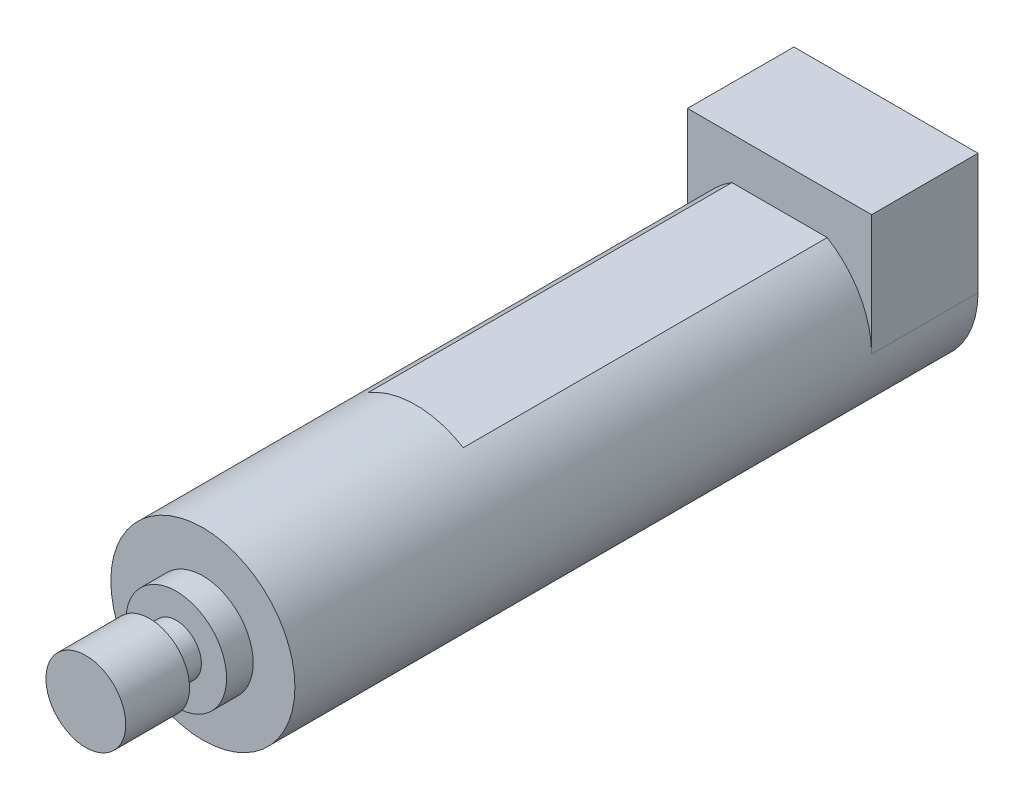
ISO-10303-21;
HEADER;
FILE_DESCRIPTION(('STEP AP214'),'2;1');
FILE_NAME('part.step','',(''),(''),'','','');
FILE_SCHEMA(('AUTOMOTIVE_DESIGN { 1 0 10303 214 1 1 1 1 }'));
ENDSEC;
DATA;
#1=APPLICATION_CONTEXT('core data for automotive mechanical design processes');
#2=APPLICATION_PROTOCOL_DEFINITION('international standard','automotive_design',2000,#1);
#3=PRODUCT_CONTEXT('',#1,'mechanical');
#4=PRODUCT('Part','Part','',(#3));
#5=PRODUCT_RELATED_PRODUCT_CATEGORY('part','',(#4));
#6=PRODUCT_DEFINITION_FORMATION('','',#4);
#7=PRODUCT_DEFINITION_CONTEXT('part definition',#1,'design');
#8=PRODUCT_DEFINITION('design','',#6,#7);
#9=PRODUCT_DEFINITION_SHAPE('','',#8);
#10=(LENGTH_UNIT() NAMED_UNIT(*) SI_UNIT(.MILLI.,.METRE.));
#11=(NAMED_UNIT(*) PLANE_ANGLE_UNIT() SI_UNIT($,.RADIAN.));
#12=(NAMED_UNIT(*) SI_UNIT($,.STERADIAN.) SOLID_ANGLE_UNIT());
#13=UNCERTAINTY_MEASURE_WITH_UNIT(LENGTH_MEASURE(1.E-05),#10,'distance_accuracy_value','');
#14=(GEOMETRIC_REPRESENTATION_CONTEXT(3) GLOBAL_UNCERTAINTY_ASSIGNED_CONTEXT((#13)) GLOBAL_UNIT_ASSIGNED_CONTEXT((#10,
#11,#12)) REPRESENTATION_CONTEXT('',''));
#15=CARTESIAN_POINT('',(0.,0.,0.));
#16=DIRECTION('',(0.,0.,1.));
#17=DIRECTION('',(1.,0.,0.));
#18=AXIS2_PLACEMENT_3D('',#15,#16,#17);
#19=CARTESIAN_POINT('',(0.,0.,12.7));
#20=DIRECTION('',(0.,0.,1.));
#21=DIRECTION('',(1.,0.,0.));
#22=AXIS2_PLACEMENT_3D('',#19,#20,#21);
#23=PLANE('',#22);
#24=CARTESIAN_POINT('',(0.,0.,12.7));
#25=DIRECTION('',(0.,0.,1.));
#26=DIRECTION('',(1.,0.,0.));
#27=AXIS2_PLACEMENT_3D('',#24,#25,#26);
#28=CIRCLE('',#27,10.9855);
#29=CARTESIAN_POINT('',(-5.68848013532613,9.398,12.7));
#30=VERTEX_POINT('',#29);
#31=CARTESIAN_POINT('',(-10.9855,0.,12.7));
#32=VERTEX_POINT('',#31);
#33=EDGE_CURVE('E51',#30,#32,#28,.T.);
#34=ORIENTED_EDGE('',*,*,#33,.F.);
#35=DIRECTION('',(-1.,0.,0.));
#36=VECTOR('',#35,1.);
#37=CARTESIAN_POINT('',(-5.68848013532613,9.398,12.7));
#38=LINE('',#37,#36);
#39=CARTESIAN_POINT('',(5.68848013532613,9.398,12.7));
#40=VERTEX_POINT('',#39);
#41=EDGE_CURVE('E55',#40,#30,#38,.T.);
#42=ORIENTED_EDGE('',*,*,#41,.F.);
#43=CARTESIAN_POINT('',(0.,0.,12.7));
#44=DIRECTION('',(0.,0.,1.));
#45=DIRECTION('',(1.,0.,0.));
#46=AXIS2_PLACEMENT_3D('',#43,#44,#45);
#47=CIRCLE('',#46,10.9855);
#48=CARTESIAN_POINT('',(10.9855,0.,12.7));
#49=VERTEX_POINT('',#48);
#50=EDGE_CURVE('E131',#49,#40,#47,.T.);
#51=ORIENTED_EDGE('',*,*,#50,.F.);
#52=DIRECTION('',(0.,1.,0.));
#53=VECTOR('',#52,1.);
#54=CARTESIAN_POINT('',(10.9855,14.4145,12.7));
#55=LINE('',#54,#53);
#56=CARTESIAN_POINT('',(10.9855,14.4145,12.7));
#57=VERTEX_POINT('',#56);
#58=EDGE_CURVE('E144',#49,#57,#55,.T.);
#59=ORIENTED_EDGE('',*,*,#58,.T.);
#60=DIRECTION('',(-1.,0.,0.));
#61=VECTOR('',#60,1.);
#62=CARTESIAN_POINT('',(-10.9855,14.4145,12.7));
#63=LINE('',#62,#61);
#64=CARTESIAN_POINT('',(-10.9855,14.4145,12.7));
#65=VERTEX_POINT('',#64);
#66=EDGE_CURVE('E147',#57,#65,#63,.T.);
#67=ORIENTED_EDGE('',*,*,#66,.T.);
#68=DIRECTION('',(0.,-1.,0.));
#69=VECTOR('',#68,1.);
#70=CARTESIAN_POINT('',(-10.9855,0.,12.7));
#71=LINE('',#70,#69);
#72=EDGE_CURVE('E149',#65,#32,#71,.T.);
#73=ORIENTED_EDGE('',*,*,#72,.T.);
#74=EDGE_LOOP('',(#34,#42,#51,#59,#67,#73));
#75=FACE_BOUND('',#74,.T.);
#76=ADVANCED_FACE('F34',(#75),#23,.T.);
#77=CARTESIAN_POINT('',(0.,0.,12.7));
#78=DIRECTION('',(0.,0.,-1.));
#79=DIRECTION('',(-1.,0.,0.));
#80=AXIS2_PLACEMENT_3D('',#77,#78,#79);
#81=CYLINDRICAL_SURFACE('',#80,10.9855);
#82=DIRECTION('',(0.,0.,-1.));
#83=VECTOR('',#82,1.);
#84=CARTESIAN_POINT('',(-5.68848013532613,-9.398,56.134));
#85=LINE('',#84,#83);
#86=CARTESIAN_POINT('',(-5.68848013532613,-9.398,56.134));
#87=VERTEX_POINT('',#86);
#88=CARTESIAN_POINT('',(-5.68848013532613,-9.398,12.7));
#89=VERTEX_POINT('',#88);
#90=EDGE_CURVE('E138',#87,#89,#85,.T.);
#91=ORIENTED_EDGE('',*,*,#90,.F.);
#92=CARTESIAN_POINT('',(0.,0.,56.134));
#93=DIRECTION('',(0.,0.,1.));
#94=DIRECTION('',(1.,0.,0.));
#95=AXIS2_PLACEMENT_3D('',#92,#93,#94);
#96=CIRCLE('',#95,10.9855);
#97=CARTESIAN_POINT('',(5.68848013532612,-9.398,56.134));
#98=VERTEX_POINT('',#97);
#99=EDGE_CURVE('E117',#87,#98,#96,.T.);
#100=ORIENTED_EDGE('',*,*,#99,.T.);
#101=DIRECTION('',(0.,0.,-1.));
#102=VECTOR('',#101,1.);
#103=CARTESIAN_POINT('',(5.68848013532612,-9.398,56.134));
#104=LINE('',#103,#102);
#105=CARTESIAN_POINT('',(5.68848013532612,-9.398,12.7));
#106=VERTEX_POINT('',#105);
#107=EDGE_CURVE('E135',#98,#106,#104,.T.);
#108=ORIENTED_EDGE('',*,*,#107,.T.);
#109=CARTESIAN_POINT('',(0.,0.,12.7));
#110=DIRECTION('',(0.,0.,1.));
#111=DIRECTION('',(1.,0.,0.));
#112=AXIS2_PLACEMENT_3D('',#109,#110,#111);
#113=CIRCLE('',#112,10.9855);
#114=EDGE_CURVE('E142',#89,#106,#113,.T.);
#115=ORIENTED_EDGE('',*,*,#114,.F.);
#116=EDGE_LOOP('',(#91,#100,#108,#115));
#117=FACE_BOUND('',#116,.T.);
#118=CARTESIAN_POINT('',(0.,0.,0.));
#119=DIRECTION('',(0.,0.,1.));
#120=DIRECTION('',(1.,0.,0.));
#121=AXIS2_PLACEMENT_3D('',#118,#119,#120);
#122=CIRCLE('',#121,10.9855);
#123=CARTESIAN_POINT('',(-10.9855,0.,0.));
#124=VERTEX_POINT('',#123);
#125=CARTESIAN_POINT('',(10.9855,0.,0.));
#126=VERTEX_POINT('',#125);
#127=EDGE_CURVE('E141',#124,#126,#122,.T.);
#128=ORIENTED_EDGE('',*,*,#127,.T.);
#129=DIRECTION('',(0.,0.,-1.));
#130=VECTOR('',#129,1.);
#131=CARTESIAN_POINT('',(10.9855,0.,12.7));
#132=LINE('',#131,#130);
#133=EDGE_CURVE('E38',#49,#126,#132,.T.);
#134=ORIENTED_EDGE('',*,*,#133,.F.);
#135=ORIENTED_EDGE('',*,*,#50,.T.);
#136=DIRECTION('',(0.,0.,-1.));
#137=VECTOR('',#136,1.);
#138=CARTESIAN_POINT('',(5.68848013532613,9.398,56.134));
#139=LINE('',#138,#137);
#140=CARTESIAN_POINT('',(5.68848013532613,9.398,56.134));
#141=VERTEX_POINT('',#140);
#142=EDGE_CURVE('E107',#141,#40,#139,.T.);
#143=ORIENTED_EDGE('',*,*,#142,.F.);
#144=CARTESIAN_POINT('',(-5.68848013532613,9.398,56.134));
#145=VERTEX_POINT('',#144);
#146=EDGE_CURVE('E111',#141,#145,#96,.T.);
#147=ORIENTED_EDGE('',*,*,#146,.T.);
#148=DIRECTION('',(0.,0.,-1.));
#149=VECTOR('',#148,1.);
#150=CARTESIAN_POINT('',(-5.68848013532613,9.398,56.134));
#151=LINE('',#150,#149);
#152=EDGE_CURVE('E99',#145,#30,#151,.T.);
#153=ORIENTED_EDGE('',*,*,#152,.T.);
#154=ORIENTED_EDGE('',*,*,#33,.T.);
#155=DIRECTION('',(0.,0.,-1.));
#156=VECTOR('',#155,1.);
#157=CARTESIAN_POINT('',(-10.9855,0.,12.7));
#158=LINE('',#157,#156);
#159=EDGE_CURVE('E151',#32,#124,#158,.T.);
#160=ORIENTED_EDGE('',*,*,#159,.T.);
#161=EDGE_LOOP('',(#128,#134,#135,#143,#147,#153,#154,#160));
#162=FACE_BOUND('',#161,.T.);
#163=CARTESIAN_POINT('',(0.,0.,81.534));
#164=DIRECTION('',(0.,0.,1.));
#165=DIRECTION('',(1.,0.,0.));
#166=AXIS2_PLACEMENT_3D('',#163,#164,#165);
#167=CIRCLE('',#166,10.9855);
#168=CARTESIAN_POINT('',(10.9855,0.,81.534));
#169=VERTEX_POINT('',#168);
#170=EDGE_CURVE('E116',#169,#169,#167,.T.);
#171=ORIENTED_EDGE('',*,*,#170,.F.);
#172=EDGE_LOOP('',(#171));
#173=FACE_BOUND('',#172,.T.);
#174=ADVANCED_FACE('F36',(#117,#162,#173),#81,.T.);
#175=CARTESIAN_POINT('',(10.9855,14.4145,12.7));
#176=DIRECTION('',(-1.,0.,0.));
#177=DIRECTION('',(0.,0.,1.));
#178=AXIS2_PLACEMENT_3D('',#175,#176,#177);
#179=PLANE('',#178);
#180=DIRECTION('',(0.,1.,0.));
#181=VECTOR('',#180,1.);
#182=CARTESIAN_POINT('',(10.9855,14.4145,0.));
#183=LINE('',#182,#181);
#184=CARTESIAN_POINT('',(10.9855,14.4145,0.));
#185=VERTEX_POINT('',#184);
#186=EDGE_CURVE('E153',#126,#185,#183,.T.);
#187=ORIENTED_EDGE('',*,*,#186,.T.);
#188=DIRECTION('',(0.,0.,-1.));
#189=VECTOR('',#188,1.);
#190=CARTESIAN_POINT('',(10.9855,14.4145,12.7));
#191=LINE('',#190,#189);
#192=EDGE_CURVE('E162',#57,#185,#191,.T.);
#193=ORIENTED_EDGE('',*,*,#192,.F.);
#194=ORIENTED_EDGE('',*,*,#58,.F.);
#195=ORIENTED_EDGE('',*,*,#133,.T.);
#196=EDGE_LOOP('',(#187,#193,#194,#195));
#197=FACE_BOUND('',#196,.T.);
#198=ADVANCED_FACE('F172',(#197),#179,.F.);
#199=CARTESIAN_POINT('',(-10.9855,14.4145,12.7));
#200=DIRECTION('',(0.,-1.,0.));
#201=DIRECTION('',(0.,0.,-1.));
#202=AXIS2_PLACEMENT_3D('',#199,#200,#201);
#203=PLANE('',#202);
#204=DIRECTION('',(-1.,0.,0.));
#205=VECTOR('',#204,1.);
#206=CARTESIAN_POINT('',(-10.9855,14.4145,0.));
#207=LINE('',#206,#205);
#208=CARTESIAN_POINT('',(-10.9855,14.4145,0.));
#209=VERTEX_POINT('',#208);
#210=EDGE_CURVE('E155',#185,#209,#207,.T.);
#211=ORIENTED_EDGE('',*,*,#210,.T.);
#212=DIRECTION('',(0.,0.,-1.));
#213=VECTOR('',#212,1.);
#214=CARTESIAN_POINT('',(-10.9855,14.4145,12.7));
#215=LINE('',#214,#213);
#216=EDGE_CURVE('E160',#65,#209,#215,.T.);
#217=ORIENTED_EDGE('',*,*,#216,.F.);
#218=ORIENTED_EDGE('',*,*,#66,.F.);
#219=ORIENTED_EDGE('',*,*,#192,.T.);
#220=EDGE_LOOP('',(#211,#217,#218,#219));
#221=FACE_BOUND('',#220,.T.);
#222=ADVANCED_FACE('F179',(#221),#203,.F.);
#223=CARTESIAN_POINT('',(-10.9855,0.,12.7));
#224=DIRECTION('',(1.,0.,0.));
#225=DIRECTION('',(0.,0.,-1.));
#226=AXIS2_PLACEMENT_3D('',#223,#224,#225);
#227=PLANE('',#226);
#228=DIRECTION('',(0.,-1.,0.));
#229=VECTOR('',#228,1.);
#230=CARTESIAN_POINT('',(-10.9855,0.,0.));
#231=LINE('',#230,#229);
#232=EDGE_CURVE('E145',#209,#124,#231,.T.);
#233=ORIENTED_EDGE('',*,*,#232,.T.);
#234=ORIENTED_EDGE('',*,*,#159,.F.);
#235=ORIENTED_EDGE('',*,*,#72,.F.);
#236=ORIENTED_EDGE('',*,*,#216,.T.);
#237=EDGE_LOOP('',(#233,#234,#235,#236));
#238=FACE_BOUND('',#237,.T.);
#239=ADVANCED_FACE('F182',(#238),#227,.F.);
#240=DIRECTION('',(1.,0.,0.));
#241=VECTOR('',#240,1.);
#242=CARTESIAN_POINT('',(-5.68848013532613,-9.398,12.7));
#243=LINE('',#242,#241);
#244=EDGE_CURVE('E128',#89,#106,#243,.T.);
#245=ORIENTED_EDGE('',*,*,#244,.F.);
#246=ORIENTED_EDGE('',*,*,#114,.T.);
#247=EDGE_LOOP('',(#245,#246));
#248=FACE_BOUND('',#247,.T.);
#249=ADVANCED_FACE('F185',(#248),#23,.T.);
#250=CARTESIAN_POINT('',(0.,0.,0.));
#251=DIRECTION('',(0.,0.,1.));
#252=DIRECTION('',(1.,0.,0.));
#253=AXIS2_PLACEMENT_3D('',#250,#251,#252);
#254=PLANE('',#253);
#255=ORIENTED_EDGE('',*,*,#127,.F.);
#256=ORIENTED_EDGE('',*,*,#232,.F.);
#257=ORIENTED_EDGE('',*,*,#210,.F.);
#258=ORIENTED_EDGE('',*,*,#186,.F.);
#259=EDGE_LOOP('',(#255,#256,#257,#258));
#260=FACE_BOUND('',#259,.T.);
#261=ADVANCED_FACE('F177',(#260),#254,.F.);
#262=CARTESIAN_POINT('',(-5.68848013532613,-9.398,56.134));
#263=DIRECTION('',(0.,1.,0.));
#264=DIRECTION('',(0.,0.,1.));
#265=AXIS2_PLACEMENT_3D('',#262,#263,#264);
#266=PLANE('',#265);
#267=ORIENTED_EDGE('',*,*,#244,.T.);
#268=ORIENTED_EDGE('',*,*,#107,.F.);
#269=DIRECTION('',(1.,0.,0.));
#270=VECTOR('',#269,1.);
#271=CARTESIAN_POINT('',(-5.68848013532613,-9.398,56.134));
#272=LINE('',#271,#270);
#273=EDGE_CURVE('E112',#87,#98,#272,.T.);
#274=ORIENTED_EDGE('',*,*,#273,.F.);
#275=ORIENTED_EDGE('',*,*,#90,.T.);
#276=EDGE_LOOP('',(#267,#268,#274,#275));
#277=FACE_BOUND('',#276,.T.);
#278=ADVANCED_FACE('F198',(#277),#266,.F.);
#279=CARTESIAN_POINT('',(-5.68848013532613,9.398,56.134));
#280=DIRECTION('',(0.,-1.,0.));
#281=DIRECTION('',(0.,0.,-1.));
#282=AXIS2_PLACEMENT_3D('',#279,#280,#281);
#283=PLANE('',#282);
#284=ORIENTED_EDGE('',*,*,#41,.T.);
#285=ORIENTED_EDGE('',*,*,#152,.F.);
#286=DIRECTION('',(-1.,0.,0.));
#287=VECTOR('',#286,1.);
#288=CARTESIAN_POINT('',(-5.68848013532613,9.398,56.134));
#289=LINE('',#288,#287);
#290=EDGE_CURVE('E103',#141,#145,#289,.T.);
#291=ORIENTED_EDGE('',*,*,#290,.F.);
#292=ORIENTED_EDGE('',*,*,#142,.T.);
#293=EDGE_LOOP('',(#284,#285,#291,#292));
#294=FACE_BOUND('',#293,.T.);
#295=ADVANCED_FACE('F101',(#294),#283,.F.);
#296=CARTESIAN_POINT('',(0.,0.,56.134));
#297=DIRECTION('',(0.,0.,1.));
#298=DIRECTION('',(1.,0.,0.));
#299=AXIS2_PLACEMENT_3D('',#296,#297,#298);
#300=PLANE('',#299);
#301=ORIENTED_EDGE('',*,*,#99,.F.);
#302=ORIENTED_EDGE('',*,*,#273,.T.);
#303=EDGE_LOOP('',(#301,#302));
#304=FACE_BOUND('',#303,.T.);
#305=ADVANCED_FACE('F205',(#304),#300,.F.);
#306=ORIENTED_EDGE('',*,*,#146,.F.);
#307=ORIENTED_EDGE('',*,*,#290,.T.);
#308=EDGE_LOOP('',(#306,#307));
#309=FACE_BOUND('',#308,.T.);
#310=ADVANCED_FACE('F110',(#309),#300,.F.);
#311=CARTESIAN_POINT('',(0.,0.,81.534));
#312=DIRECTION('',(0.,0.,1.));
#313=DIRECTION('',(1.,0.,0.));
#314=AXIS2_PLACEMENT_3D('',#311,#312,#313);
#315=PLANE('',#314);
#316=CARTESIAN_POINT('',(0.,0.,81.534));
#317=DIRECTION('',(0.,0.,1.));
#318=DIRECTION('',(1.,0.,0.));
#319=AXIS2_PLACEMENT_3D('',#316,#317,#318);
#320=CIRCLE('',#319,6.0071);
#321=CARTESIAN_POINT('',(6.0071,0.,81.534));
#322=VERTEX_POINT('',#321);
#323=EDGE_CURVE('E43',#322,#322,#320,.T.);
#324=ORIENTED_EDGE('',*,*,#323,.F.);
#325=EDGE_LOOP('',(#324));
#326=FACE_BOUND('',#325,.T.);
#327=ORIENTED_EDGE('',*,*,#170,.T.);
#328=EDGE_LOOP('',(#327));
#329=FACE_BOUND('',#328,.T.);
#330=ADVANCED_FACE('F212',(#326,#329),#315,.T.);
#331=CARTESIAN_POINT('',(0.,0.,84.709));
#332=DIRECTION('',(0.,0.,-1.));
#333=DIRECTION('',(-1.,0.,0.));
#334=AXIS2_PLACEMENT_3D('',#331,#332,#333);
#335=CYLINDRICAL_SURFACE('',#334,6.0071);
#336=CARTESIAN_POINT('',(0.,0.,84.709));
#337=DIRECTION('',(0.,0.,1.));
#338=DIRECTION('',(1.,0.,0.));
#339=AXIS2_PLACEMENT_3D('',#336,#337,#338);
#340=CIRCLE('',#339,6.0071);
#341=CARTESIAN_POINT('',(6.0071,0.,84.709));
#342=VERTEX_POINT('',#341);
#343=EDGE_CURVE('E122',#342,#342,#340,.T.);
#344=ORIENTED_EDGE('',*,*,#343,.F.);
#345=EDGE_LOOP('',(#344));
#346=FACE_BOUND('',#345,.T.);
#347=ORIENTED_EDGE('',*,*,#323,.T.);
#348=EDGE_LOOP('',(#347));
#349=FACE_BOUND('',#348,.T.);
#350=ADVANCED_FACE('F246',(#346,#349),#335,.T.);
#351=CARTESIAN_POINT('',(0.,0.,84.709));
#352=DIRECTION('',(0.,0.,1.));
#353=DIRECTION('',(1.,0.,0.));
#354=AXIS2_PLACEMENT_3D('',#351,#352,#353);
#355=PLANE('',#354);
#356=CARTESIAN_POINT('',(0.,0.,84.709));
#357=DIRECTION('',(0.,0.,1.));
#358=DIRECTION('',(1.,0.,0.));
#359=AXIS2_PLACEMENT_3D('',#356,#357,#358);
#360=CIRCLE('',#359,2.9972);
#361=CARTESIAN_POINT('',(2.9972,0.,84.709));
#362=VERTEX_POINT('',#361);
#363=EDGE_CURVE('E11',#362,#362,#360,.T.);
#364=ORIENTED_EDGE('',*,*,#363,.F.);
#365=EDGE_LOOP('',(#364));
#366=FACE_BOUND('',#365,.T.);
#367=ORIENTED_EDGE('',*,*,#343,.T.);
#368=EDGE_LOOP('',(#367));
#369=FACE_BOUND('',#368,.T.);
#370=ADVANCED_FACE('F255',(#366,#369),#355,.T.);
#371=CARTESIAN_POINT('',(0.,0.,87.884));
#372=DIRECTION('',(0.,0.,-1.));
#373=DIRECTION('',(-1.,0.,0.));
#374=AXIS2_PLACEMENT_3D('',#371,#372,#373);
#375=CYLINDRICAL_SURFACE('',#374,2.9972);
#376=CARTESIAN_POINT('',(0.,0.,87.884));
#377=DIRECTION('',(0.,0.,1.));
#378=DIRECTION('',(1.,0.,0.));
#379=AXIS2_PLACEMENT_3D('',#376,#377,#378);
#380=CIRCLE('',#379,2.9972);
#381=CARTESIAN_POINT('',(2.9972,0.,87.884));
#382=VERTEX_POINT('',#381);
#383=EDGE_CURVE('E311',#382,#382,#380,.T.);
#384=ORIENTED_EDGE('',*,*,#383,.F.);
#385=EDGE_LOOP('',(#384));
#386=FACE_BOUND('',#385,.T.);
#387=ORIENTED_EDGE('',*,*,#363,.T.);
#388=EDGE_LOOP('',(#387));
#389=FACE_BOUND('',#388,.T.);
#390=ADVANCED_FACE('F264',(#386,#389),#375,.T.);
#391=CARTESIAN_POINT('',(0.,0.,95.504));
#392=DIRECTION('',(0.,0.,-1.));
#393=DIRECTION('',(-1.,0.,0.));
#394=AXIS2_PLACEMENT_3D('',#391,#392,#393);
#395=CYLINDRICAL_SURFACE('',#394,4.7625);
#396=CARTESIAN_POINT('',(0.,0.,95.504));
#397=DIRECTION('',(0.,0.,1.));
#398=DIRECTION('',(1.,0.,0.));
#399=AXIS2_PLACEMENT_3D('',#396,#397,#398);
#400=CIRCLE('',#399,4.7625);
#401=CARTESIAN_POINT('',(4.7625,0.,95.504));
#402=VERTEX_POINT('',#401);
#403=EDGE_CURVE('E316',#402,#402,#400,.T.);
#404=ORIENTED_EDGE('',*,*,#403,.F.);
#405=EDGE_LOOP('',(#404));
#406=FACE_BOUND('',#405,.T.);
#407=CARTESIAN_POINT('',(0.,0.,87.884));
#408=DIRECTION('',(0.,0.,1.));
#409=DIRECTION('',(1.,0.,0.));
#410=AXIS2_PLACEMENT_3D('',#407,#408,#409);
#411=CIRCLE('',#410,4.7625);
#412=CARTESIAN_POINT('',(4.7625,0.,87.884));
#413=VERTEX_POINT('',#412);
#414=EDGE_CURVE('E314',#413,#413,#411,.T.);
#415=ORIENTED_EDGE('',*,*,#414,.T.);
#416=EDGE_LOOP('',(#415));
#417=FACE_BOUND('',#416,.T.);
#418=ADVANCED_FACE('F274',(#406,#417),#395,.T.);
#419=CARTESIAN_POINT('',(0.,0.,95.504));
#420=DIRECTION('',(0.,0.,1.));
#421=DIRECTION('',(1.,0.,0.));
#422=AXIS2_PLACEMENT_3D('',#419,#420,#421);
#423=PLANE('',#422);
#424=ORIENTED_EDGE('',*,*,#403,.T.);
#425=EDGE_LOOP('',(#424));
#426=FACE_BOUND('',#425,.T.);
#427=ADVANCED_FACE('F284',(#426),#423,.T.);
#428=CARTESIAN_POINT('',(0.,0.,87.884));
#429=DIRECTION('',(0.,0.,1.));
#430=DIRECTION('',(1.,0.,0.));
#431=AXIS2_PLACEMENT_3D('',#428,#429,#430);
#432=PLANE('',#431);
#433=ORIENTED_EDGE('',*,*,#383,.T.);
#434=EDGE_LOOP('',(#433));
#435=FACE_BOUND('',#434,.T.);
#436=ORIENTED_EDGE('',*,*,#414,.F.);
#437=EDGE_LOOP('',(#436));
#438=FACE_BOUND('',#437,.T.);
#439=ADVANCED_FACE('F294',(#435,#438),#432,.F.);
#440=CLOSED_SHELL('',(#76,#174,#198,#222,#239,#249,#261,#278,#295,#305,#310,#330,#350,#370,#390,
#418,#427,#439));
#441=MANIFOLD_SOLID_BREP('B2',#440);
#442=ADVANCED_BREP_SHAPE_REPRESENTATION('',(#18,#441),#14);
#443=SHAPE_DEFINITION_REPRESENTATION(#9,#442);
ENDSEC;
END-ISO-10303-21;
